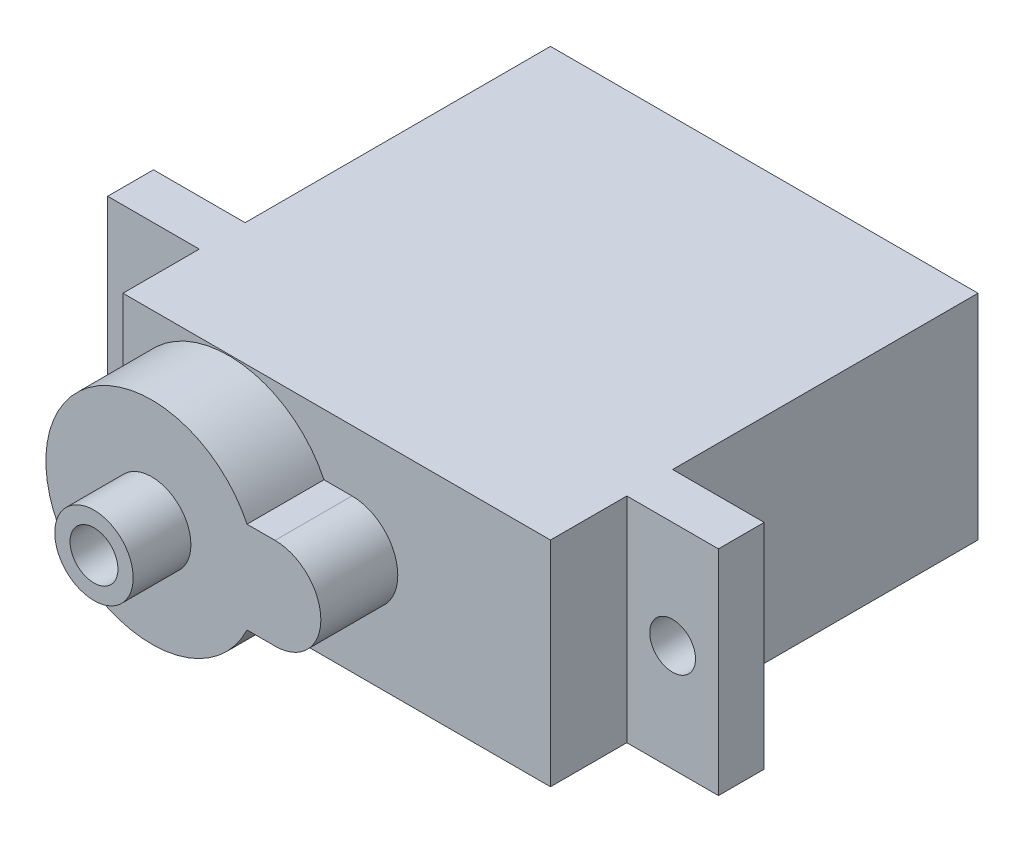
ISO-10303-21;
HEADER;
FILE_DESCRIPTION(('STEP AP214'),'2;1');
FILE_NAME('part.step','',(''),(''),'','','');
FILE_SCHEMA(('AUTOMOTIVE_DESIGN { 1 0 10303 214 1 1 1 1 }'));
ENDSEC;
DATA;
#1=APPLICATION_CONTEXT('core data for automotive mechanical design processes');
#2=APPLICATION_PROTOCOL_DEFINITION('international standard','automotive_design',2000,#1);
#3=PRODUCT_CONTEXT('',#1,'mechanical');
#4=PRODUCT('Part','Part','',(#3));
#5=PRODUCT_RELATED_PRODUCT_CATEGORY('part','',(#4));
#6=PRODUCT_DEFINITION_FORMATION('','',#4);
#7=PRODUCT_DEFINITION_CONTEXT('part definition',#1,'design');
#8=PRODUCT_DEFINITION('design','',#6,#7);
#9=PRODUCT_DEFINITION_SHAPE('','',#8);
#10=(LENGTH_UNIT() NAMED_UNIT(*) SI_UNIT(.MILLI.,.METRE.));
#11=(NAMED_UNIT(*) PLANE_ANGLE_UNIT() SI_UNIT($,.RADIAN.));
#12=(NAMED_UNIT(*) SI_UNIT($,.STERADIAN.) SOLID_ANGLE_UNIT());
#13=UNCERTAINTY_MEASURE_WITH_UNIT(LENGTH_MEASURE(1.E-05),#10,'distance_accuracy_value','');
#14=(GEOMETRIC_REPRESENTATION_CONTEXT(3) GLOBAL_UNCERTAINTY_ASSIGNED_CONTEXT((#13)) GLOBAL_UNIT_ASSIGNED_CONTEXT((#10,
#11,#12)) REPRESENTATION_CONTEXT('',''));
#15=CARTESIAN_POINT('',(0.,0.,0.));
#16=DIRECTION('',(0.,0.,1.));
#17=DIRECTION('',(1.,0.,0.));
#18=AXIS2_PLACEMENT_3D('',#15,#16,#17);
#19=CARTESIAN_POINT('',(0.,0.,26.225));
#20=DIRECTION('',(0.,0.,1.));
#21=DIRECTION('',(1.,0.,0.));
#22=AXIS2_PLACEMENT_3D('',#19,#20,#21);
#23=PLANE('',#22);
#24=DIRECTION('',(-1.,0.,0.));
#25=VECTOR('',#24,1.);
#26=CARTESIAN_POINT('',(0.,-2.38125656149906,26.225));
#27=LINE('',#26,#25);
#28=CARTESIAN_POINT('',(1.01053601839695,-2.38125656149906,26.225));
#29=VERTEX_POINT('',#28);
#30=CARTESIAN_POINT('',(-0.44419736512808,-2.38125656149906,26.225));
#31=VERTEX_POINT('',#30);
#32=EDGE_CURVE('E247',#29,#31,#27,.T.);
#33=ORIENTED_EDGE('',*,*,#32,.F.);
#34=CARTESIAN_POINT('',(1.01053601839692,3.67197356602013E-05,26.225));
#35=DIRECTION('',(0.,0.,1.));
#36=DIRECTION('',(1.,0.,0.));
#37=AXIS2_PLACEMENT_3D('',#34,#35,#36);
#38=CIRCLE('',#37,2.38129328074953);
#39=CARTESIAN_POINT('',(1.010604,2.38133,26.225));
#40=VERTEX_POINT('',#39);
#41=EDGE_CURVE('E250',#29,#40,#38,.T.);
#42=ORIENTED_EDGE('',*,*,#41,.T.);
#43=DIRECTION('',(-1.,0.,0.));
#44=VECTOR('',#43,1.);
#45=CARTESIAN_POINT('',(0.,2.38133,26.225));
#46=LINE('',#45,#44);
#47=CARTESIAN_POINT('',(-0.444232638800502,2.38133,26.225));
#48=VERTEX_POINT('',#47);
#49=EDGE_CURVE('E253',#40,#48,#46,.T.);
#50=ORIENTED_EDGE('',*,*,#49,.T.);
#51=CARTESIAN_POINT('',(-5.40198086063468,0.,26.225));
#52=DIRECTION('',(0.,0.,1.));
#53=DIRECTION('',(1.,0.,0.));
#54=AXIS2_PLACEMENT_3D('',#51,#52,#53);
#55=CIRCLE('',#54,5.5);
#56=CARTESIAN_POINT('',(-10.89565,0.263816957728569,26.225));
#57=VERTEX_POINT('',#56);
#58=EDGE_CURVE('E255',#48,#57,#55,.T.);
#59=ORIENTED_EDGE('',*,*,#58,.T.);
#60=DIRECTION('',(0.,-1.,0.));
#61=VECTOR('',#60,1.);
#62=CARTESIAN_POINT('',(-10.89565,0.,26.225));
#63=LINE('',#62,#61);
#64=CARTESIAN_POINT('',(-10.89565,-0.263816957728569,26.225));
#65=VERTEX_POINT('',#64);
#66=EDGE_CURVE('E257',#57,#65,#63,.T.);
#67=ORIENTED_EDGE('',*,*,#66,.T.);
#68=EDGE_CURVE('E258',#65,#31,#55,.T.);
#69=ORIENTED_EDGE('',*,*,#68,.T.);
#70=EDGE_LOOP('',(#33,#42,#50,#59,#67,#69));
#71=FACE_BOUND('',#70,.T.);
#72=CARTESIAN_POINT('',(-5.40198086063468,0.,26.225));
#73=DIRECTION('',(0.,0.,1.));
#74=DIRECTION('',(1.,0.,0.));
#75=AXIS2_PLACEMENT_3D('',#72,#73,#74);
#76=CIRCLE('',#75,2.0388374802303);
#77=CARTESIAN_POINT('',(-3.36314338040439,0.,26.225));
#78=VERTEX_POINT('',#77);
#79=EDGE_CURVE('E241',#78,#78,#76,.T.);
#80=ORIENTED_EDGE('',*,*,#79,.F.);
#81=EDGE_LOOP('',(#80));
#82=FACE_BOUND('',#81,.T.);
#83=ADVANCED_FACE('F39',(#71,#82),#23,.T.);
#84=CARTESIAN_POINT('',(11.32935,5.555,22.225));
#85=DIRECTION('',(0.,0.,-1.));
#86=DIRECTION('',(-1.,0.,0.));
#87=AXIS2_PLACEMENT_3D('',#84,#85,#86);
#88=PLANE('',#87);
#89=CARTESIAN_POINT('',(-5.40198086063468,0.,22.225));
#90=DIRECTION('',(0.,0.,1.));
#91=DIRECTION('',(1.,0.,0.));
#92=AXIS2_PLACEMENT_3D('',#89,#90,#91);
#93=CIRCLE('',#92,5.5);
#94=CARTESIAN_POINT('',(-10.89565,-0.263816957728569,22.225));
#95=VERTEX_POINT('',#94);
#96=CARTESIAN_POINT('',(-0.44419736512808,-2.38125656149906,22.225));
#97=VERTEX_POINT('',#96);
#98=EDGE_CURVE('E251',#95,#97,#93,.T.);
#99=ORIENTED_EDGE('',*,*,#98,.F.);
#100=DIRECTION('',(0.,-1.,0.));
#101=VECTOR('',#100,1.);
#102=CARTESIAN_POINT('',(-10.89565,5.555,22.225));
#103=LINE('',#102,#101);
#104=CARTESIAN_POINT('',(-10.89565,-5.555,22.225));
#105=VERTEX_POINT('',#104);
#106=EDGE_CURVE('E280',#95,#105,#103,.T.);
#107=ORIENTED_EDGE('',*,*,#106,.T.);
#108=DIRECTION('',(1.,0.,0.));
#109=VECTOR('',#108,1.);
#110=CARTESIAN_POINT('',(11.32935,-5.555,22.225));
#111=LINE('',#110,#109);
#112=CARTESIAN_POINT('',(11.32935,-5.555,22.225));
#113=VERTEX_POINT('',#112);
#114=EDGE_CURVE('E372',#105,#113,#111,.T.);
#115=ORIENTED_EDGE('',*,*,#114,.T.);
#116=DIRECTION('',(0.,-1.,0.));
#117=VECTOR('',#116,1.);
#118=CARTESIAN_POINT('',(11.32935,5.555,22.225));
#119=LINE('',#118,#117);
#120=CARTESIAN_POINT('',(11.32935,5.555,22.225));
#121=VERTEX_POINT('',#120);
#122=EDGE_CURVE('E330',#121,#113,#119,.T.);
#123=ORIENTED_EDGE('',*,*,#122,.F.);
#124=DIRECTION('',(1.,0.,0.));
#125=VECTOR('',#124,1.);
#126=CARTESIAN_POINT('',(11.32935,5.555,22.225));
#127=LINE('',#126,#125);
#128=CARTESIAN_POINT('',(-10.89565,5.555,22.225));
#129=VERTEX_POINT('',#128);
#130=EDGE_CURVE('E430',#129,#121,#127,.T.);
#131=ORIENTED_EDGE('',*,*,#130,.F.);
#132=CARTESIAN_POINT('',(-10.89565,0.263816957728569,22.225));
#133=VERTEX_POINT('',#132);
#134=EDGE_CURVE('E329',#129,#133,#103,.T.);
#135=ORIENTED_EDGE('',*,*,#134,.T.);
#136=CARTESIAN_POINT('',(-0.444232638800502,2.38133,22.225));
#137=VERTEX_POINT('',#136);
#138=EDGE_CURVE('E267',#137,#133,#93,.T.);
#139=ORIENTED_EDGE('',*,*,#138,.F.);
#140=DIRECTION('',(-1.,0.,0.));
#141=VECTOR('',#140,1.);
#142=CARTESIAN_POINT('',(0.,2.38133,22.225));
#143=LINE('',#142,#141);
#144=CARTESIAN_POINT('',(1.010604,2.38133,22.225));
#145=VERTEX_POINT('',#144);
#146=EDGE_CURVE('E264',#145,#137,#143,.T.);
#147=ORIENTED_EDGE('',*,*,#146,.F.);
#148=CARTESIAN_POINT('',(1.01053601839692,3.67197356602013E-05,22.225));
#149=DIRECTION('',(0.,0.,1.));
#150=DIRECTION('',(1.,0.,0.));
#151=AXIS2_PLACEMENT_3D('',#148,#149,#150);
#152=CIRCLE('',#151,2.38129328074953);
#153=CARTESIAN_POINT('',(1.01053601839695,-2.38125656149906,22.225));
#154=VERTEX_POINT('',#153);
#155=EDGE_CURVE('E261',#154,#145,#152,.T.);
#156=ORIENTED_EDGE('',*,*,#155,.F.);
#157=DIRECTION('',(-1.,0.,0.));
#158=VECTOR('',#157,1.);
#159=CARTESIAN_POINT('',(0.,-2.38125656149906,22.225));
#160=LINE('',#159,#158);
#161=EDGE_CURVE('E63',#154,#97,#160,.T.);
#162=ORIENTED_EDGE('',*,*,#161,.T.);
#163=EDGE_LOOP('',(#99,#107,#115,#123,#131,#135,#139,#147,#156,#162));
#164=FACE_BOUND('',#163,.T.);
#165=ADVANCED_FACE('F474',(#164),#88,.F.);
#166=CARTESIAN_POINT('',(11.32935,5.555,0.));
#167=DIRECTION('',(-1.,0.,0.));
#168=DIRECTION('',(0.,0.,1.));
#169=AXIS2_PLACEMENT_3D('',#166,#167,#168);
#170=PLANE('',#169);
#171=DIRECTION('',(0.,0.,-1.));
#172=VECTOR('',#171,1.);
#173=CARTESIAN_POINT('',(11.32935,-5.555,0.));
#174=LINE('',#173,#172);
#175=CARTESIAN_POINT('',(11.32935,-5.555,15.875));
#176=VERTEX_POINT('',#175);
#177=CARTESIAN_POINT('',(11.32935,-5.555,0.));
#178=VERTEX_POINT('',#177);
#179=EDGE_CURVE('E304',#176,#178,#174,.T.);
#180=ORIENTED_EDGE('',*,*,#179,.T.);
#181=DIRECTION('',(0.,-1.,0.));
#182=VECTOR('',#181,1.);
#183=CARTESIAN_POINT('',(11.32935,5.555,0.));
#184=LINE('',#183,#182);
#185=CARTESIAN_POINT('',(11.32935,5.555,0.));
#186=VERTEX_POINT('',#185);
#187=EDGE_CURVE('E48',#186,#178,#184,.T.);
#188=ORIENTED_EDGE('',*,*,#187,.F.);
#189=DIRECTION('',(0.,0.,-1.));
#190=VECTOR('',#189,1.);
#191=CARTESIAN_POINT('',(11.32935,5.555,0.));
#192=LINE('',#191,#190);
#193=CARTESIAN_POINT('',(11.32935,5.555,15.875));
#194=VERTEX_POINT('',#193);
#195=EDGE_CURVE('E387',#194,#186,#192,.T.);
#196=ORIENTED_EDGE('',*,*,#195,.F.);
#197=DIRECTION('',(0.,-1.,0.));
#198=VECTOR('',#197,1.);
#199=CARTESIAN_POINT('',(11.32935,5.555,15.875));
#200=LINE('',#199,#198);
#201=EDGE_CURVE('E388',#194,#176,#200,.T.);
#202=ORIENTED_EDGE('',*,*,#201,.T.);
#203=EDGE_LOOP('',(#180,#188,#196,#202));
#204=FACE_BOUND('',#203,.T.);
#205=ADVANCED_FACE('F41',(#204),#170,.F.);
#206=CARTESIAN_POINT('',(-10.89565,5.555,0.));
#207=DIRECTION('',(0.,0.,1.));
#208=DIRECTION('',(1.,0.,0.));
#209=AXIS2_PLACEMENT_3D('',#206,#207,#208);
#210=PLANE('',#209);
#211=DIRECTION('',(-1.,0.,0.));
#212=VECTOR('',#211,1.);
#213=CARTESIAN_POINT('',(-10.89565,-5.555,0.));
#214=LINE('',#213,#212);
#215=CARTESIAN_POINT('',(-10.89565,-5.555,0.));
#216=VERTEX_POINT('',#215);
#217=EDGE_CURVE('E439',#178,#216,#214,.T.);
#218=ORIENTED_EDGE('',*,*,#217,.T.);
#219=DIRECTION('',(0.,-1.,0.));
#220=VECTOR('',#219,1.);
#221=CARTESIAN_POINT('',(-10.89565,5.555,0.));
#222=LINE('',#221,#220);
#223=CARTESIAN_POINT('',(-10.89565,5.555,0.));
#224=VERTEX_POINT('',#223);
#225=EDGE_CURVE('E350',#224,#216,#222,.T.);
#226=ORIENTED_EDGE('',*,*,#225,.F.);
#227=DIRECTION('',(-1.,0.,0.));
#228=VECTOR('',#227,1.);
#229=CARTESIAN_POINT('',(-10.89565,5.555,0.));
#230=LINE('',#229,#228);
#231=EDGE_CURVE('E416',#186,#224,#230,.T.);
#232=ORIENTED_EDGE('',*,*,#231,.F.);
#233=ORIENTED_EDGE('',*,*,#187,.T.);
#234=EDGE_LOOP('',(#218,#226,#232,#233));
#235=FACE_BOUND('',#234,.T.);
#236=ADVANCED_FACE('F459',(#235),#210,.F.);
#237=CARTESIAN_POINT('',(-10.89565,5.555,15.875));
#238=DIRECTION('',(1.,0.,0.));
#239=DIRECTION('',(0.,0.,-1.));
#240=AXIS2_PLACEMENT_3D('',#237,#238,#239);
#241=PLANE('',#240);
#242=DIRECTION('',(0.,0.,-1.));
#243=VECTOR('',#242,1.);
#244=CARTESIAN_POINT('',(-10.89565,-2.,4.));
#245=LINE('',#244,#243);
#246=CARTESIAN_POINT('',(-10.89565,-2.,4.));
#247=VERTEX_POINT('',#246);
#248=CARTESIAN_POINT('',(-10.89565,-2.,3.));
#249=VERTEX_POINT('',#248);
#250=EDGE_CURVE('E214',#247,#249,#245,.T.);
#251=ORIENTED_EDGE('',*,*,#250,.T.);
#252=DIRECTION('',(0.,1.,0.));
#253=VECTOR('',#252,1.);
#254=CARTESIAN_POINT('',(-10.89565,-2.,3.));
#255=LINE('',#254,#253);
#256=CARTESIAN_POINT('',(-10.89565,2.,3.));
#257=VERTEX_POINT('',#256);
#258=EDGE_CURVE('E221',#249,#257,#255,.T.);
#259=ORIENTED_EDGE('',*,*,#258,.T.);
#260=DIRECTION('',(0.,0.,1.));
#261=VECTOR('',#260,1.);
#262=CARTESIAN_POINT('',(-10.89565,2.,4.));
#263=LINE('',#262,#261);
#264=CARTESIAN_POINT('',(-10.89565,2.,4.));
#265=VERTEX_POINT('',#264);
#266=EDGE_CURVE('E194',#257,#265,#263,.T.);
#267=ORIENTED_EDGE('',*,*,#266,.T.);
#268=DIRECTION('',(0.,-1.,0.));
#269=VECTOR('',#268,1.);
#270=CARTESIAN_POINT('',(-10.89565,-2.,4.));
#271=LINE('',#270,#269);
#272=EDGE_CURVE('E55',#265,#247,#271,.T.);
#273=ORIENTED_EDGE('',*,*,#272,.T.);
#274=EDGE_LOOP('',(#251,#259,#267,#273));
#275=FACE_BOUND('',#274,.T.);
#276=DIRECTION('',(0.,0.,1.));
#277=VECTOR('',#276,1.);
#278=CARTESIAN_POINT('',(-10.89565,-5.555,15.875));
#279=LINE('',#278,#277);
#280=CARTESIAN_POINT('',(-10.89565,-5.555,15.875));
#281=VERTEX_POINT('',#280);
#282=EDGE_CURVE('E441',#216,#281,#279,.T.);
#283=ORIENTED_EDGE('',*,*,#282,.T.);
#284=DIRECTION('',(0.,-1.,0.));
#285=VECTOR('',#284,1.);
#286=CARTESIAN_POINT('',(-10.89565,5.555,15.875));
#287=LINE('',#286,#285);
#288=CARTESIAN_POINT('',(-10.89565,5.555,15.875));
#289=VERTEX_POINT('',#288);
#290=EDGE_CURVE('E353',#289,#281,#287,.T.);
#291=ORIENTED_EDGE('',*,*,#290,.F.);
#292=DIRECTION('',(0.,0.,1.));
#293=VECTOR('',#292,1.);
#294=CARTESIAN_POINT('',(-10.89565,5.555,15.875));
#295=LINE('',#294,#293);
#296=EDGE_CURVE('E418',#224,#289,#295,.T.);
#297=ORIENTED_EDGE('',*,*,#296,.F.);
#298=ORIENTED_EDGE('',*,*,#225,.T.);
#299=EDGE_LOOP('',(#283,#291,#297,#298));
#300=FACE_BOUND('',#299,.T.);
#301=ADVANCED_FACE('F456',(#275,#300),#241,.F.);
#302=CARTESIAN_POINT('',(-15.65815,5.555,15.875));
#303=DIRECTION('',(0.,0.,1.));
#304=DIRECTION('',(1.,0.,0.));
#305=AXIS2_PLACEMENT_3D('',#302,#303,#304);
#306=PLANE('',#305);
#307=CARTESIAN_POINT('',(-13.2769375519628,5.85583144663195E-05,15.875));
#308=DIRECTION('',(0.,0.,1.));
#309=DIRECTION('',(1.,0.,0.));
#310=AXIS2_PLACEMENT_3D('',#307,#308,#309);
#311=CIRCLE('',#310,1.19060291253007);
#312=CARTESIAN_POINT('',(-12.0863346394327,5.85583144663195E-05,15.875));
#313=VERTEX_POINT('',#312);
#314=EDGE_CURVE('E235',#313,#313,#311,.T.);
#315=ORIENTED_EDGE('',*,*,#314,.T.);
#316=EDGE_LOOP('',(#315));
#317=FACE_BOUND('',#316,.T.);
#318=DIRECTION('',(-1.,0.,0.));
#319=VECTOR('',#318,1.);
#320=CARTESIAN_POINT('',(-15.65815,-5.555,15.875));
#321=LINE('',#320,#319);
#322=CARTESIAN_POINT('',(-15.65815,-5.555,15.875));
#323=VERTEX_POINT('',#322);
#324=EDGE_CURVE('E443',#281,#323,#321,.T.);
#325=ORIENTED_EDGE('',*,*,#324,.T.);
#326=DIRECTION('',(0.,-1.,0.));
#327=VECTOR('',#326,1.);
#328=CARTESIAN_POINT('',(-15.65815,5.555,15.875));
#329=LINE('',#328,#327);
#330=CARTESIAN_POINT('',(-15.65815,5.555,15.875));
#331=VERTEX_POINT('',#330);
#332=EDGE_CURVE('E356',#331,#323,#329,.T.);
#333=ORIENTED_EDGE('',*,*,#332,.F.);
#334=DIRECTION('',(-1.,0.,0.));
#335=VECTOR('',#334,1.);
#336=CARTESIAN_POINT('',(-15.65815,5.555,15.875));
#337=LINE('',#336,#335);
#338=EDGE_CURVE('E423',#289,#331,#337,.T.);
#339=ORIENTED_EDGE('',*,*,#338,.F.);
#340=ORIENTED_EDGE('',*,*,#290,.T.);
#341=EDGE_LOOP('',(#325,#333,#339,#340));
#342=FACE_BOUND('',#341,.T.);
#343=ADVANCED_FACE('F451',(#317,#342),#306,.F.);
#344=CARTESIAN_POINT('',(-15.65815,5.555,18.25625));
#345=DIRECTION('',(1.,0.,0.));
#346=DIRECTION('',(0.,0.,-1.));
#347=AXIS2_PLACEMENT_3D('',#344,#345,#346);
#348=PLANE('',#347);
#349=DIRECTION('',(0.,0.,1.));
#350=VECTOR('',#349,1.);
#351=CARTESIAN_POINT('',(-15.65815,-5.555,18.25625));
#352=LINE('',#351,#350);
#353=CARTESIAN_POINT('',(-15.65815,-5.555,18.25625));
#354=VERTEX_POINT('',#353);
#355=EDGE_CURVE('E376',#323,#354,#352,.T.);
#356=ORIENTED_EDGE('',*,*,#355,.T.);
#357=DIRECTION('',(0.,-1.,0.));
#358=VECTOR('',#357,1.);
#359=CARTESIAN_POINT('',(-15.65815,5.555,18.25625));
#360=LINE('',#359,#358);
#361=CARTESIAN_POINT('',(-15.65815,5.555,18.25625));
#362=VERTEX_POINT('',#361);
#363=EDGE_CURVE('E358',#362,#354,#360,.T.);
#364=ORIENTED_EDGE('',*,*,#363,.F.);
#365=DIRECTION('',(0.,0.,1.));
#366=VECTOR('',#365,1.);
#367=CARTESIAN_POINT('',(-15.65815,5.555,18.25625));
#368=LINE('',#367,#366);
#369=EDGE_CURVE('E425',#331,#362,#368,.T.);
#370=ORIENTED_EDGE('',*,*,#369,.F.);
#371=ORIENTED_EDGE('',*,*,#332,.T.);
#372=EDGE_LOOP('',(#356,#364,#370,#371));
#373=FACE_BOUND('',#372,.T.);
#374=ADVANCED_FACE('F445',(#373),#348,.F.);
#375=CARTESIAN_POINT('',(-10.89565,5.555,18.25625));
#376=DIRECTION('',(0.,0.,-1.));
#377=DIRECTION('',(-1.,0.,0.));
#378=AXIS2_PLACEMENT_3D('',#375,#376,#377);
#379=PLANE('',#378);
#380=CARTESIAN_POINT('',(-13.2769375519628,5.85583144663195E-05,18.25625));
#381=DIRECTION('',(0.,0.,1.));
#382=DIRECTION('',(1.,0.,0.));
#383=AXIS2_PLACEMENT_3D('',#380,#381,#382);
#384=CIRCLE('',#383,1.19060291253007);
#385=CARTESIAN_POINT('',(-12.0863346394327,5.85583144663195E-05,18.25625));
#386=VERTEX_POINT('',#385);
#387=EDGE_CURVE('E232',#386,#386,#384,.T.);
#388=ORIENTED_EDGE('',*,*,#387,.F.);
#389=EDGE_LOOP('',(#388));
#390=FACE_BOUND('',#389,.T.);
#391=DIRECTION('',(1.,0.,0.));
#392=VECTOR('',#391,1.);
#393=CARTESIAN_POINT('',(-10.89565,-5.555,18.25625));
#394=LINE('',#393,#392);
#395=CARTESIAN_POINT('',(-10.89565,-5.555,18.25625));
#396=VERTEX_POINT('',#395);
#397=EDGE_CURVE('E371',#354,#396,#394,.T.);
#398=ORIENTED_EDGE('',*,*,#397,.T.);
#399=DIRECTION('',(0.,-1.,0.));
#400=VECTOR('',#399,1.);
#401=CARTESIAN_POINT('',(-10.89565,5.555,18.25625));
#402=LINE('',#401,#400);
#403=CARTESIAN_POINT('',(-10.89565,5.555,18.25625));
#404=VERTEX_POINT('',#403);
#405=EDGE_CURVE('E331',#404,#396,#402,.T.);
#406=ORIENTED_EDGE('',*,*,#405,.F.);
#407=DIRECTION('',(1.,0.,0.));
#408=VECTOR('',#407,1.);
#409=CARTESIAN_POINT('',(-10.89565,5.555,18.25625));
#410=LINE('',#409,#408);
#411=EDGE_CURVE('E427',#362,#404,#410,.T.);
#412=ORIENTED_EDGE('',*,*,#411,.F.);
#413=ORIENTED_EDGE('',*,*,#363,.T.);
#414=EDGE_LOOP('',(#398,#406,#412,#413));
#415=FACE_BOUND('',#414,.T.);
#416=ADVANCED_FACE('F461',(#390,#415),#379,.F.);
#417=CARTESIAN_POINT('',(-10.89565,5.555,22.225));
#418=DIRECTION('',(1.,0.,0.));
#419=DIRECTION('',(0.,0.,-1.));
#420=AXIS2_PLACEMENT_3D('',#417,#418,#419);
#421=PLANE('',#420);
#422=DIRECTION('',(0.,0.,1.));
#423=VECTOR('',#422,1.);
#424=CARTESIAN_POINT('',(-10.89565,-5.555,22.225));
#425=LINE('',#424,#423);
#426=EDGE_CURVE('E327',#396,#105,#425,.T.);
#427=ORIENTED_EDGE('',*,*,#426,.T.);
#428=ORIENTED_EDGE('',*,*,#106,.F.);
#429=DIRECTION('',(0.,0.,-1.));
#430=VECTOR('',#429,1.);
#431=CARTESIAN_POINT('',(-10.89565,-0.263816957728569,26.225));
#432=LINE('',#431,#430);
#433=EDGE_CURVE('E283',#65,#95,#432,.T.);
#434=ORIENTED_EDGE('',*,*,#433,.F.);
#435=ORIENTED_EDGE('',*,*,#66,.F.);
#436=DIRECTION('',(0.,0.,-1.));
#437=VECTOR('',#436,1.);
#438=CARTESIAN_POINT('',(-10.89565,0.263816957728569,26.225));
#439=LINE('',#438,#437);
#440=EDGE_CURVE('E285',#57,#133,#439,.T.);
#441=ORIENTED_EDGE('',*,*,#440,.T.);
#442=ORIENTED_EDGE('',*,*,#134,.F.);
#443=DIRECTION('',(0.,0.,1.));
#444=VECTOR('',#443,1.);
#445=CARTESIAN_POINT('',(-10.89565,5.555,22.225));
#446=LINE('',#445,#444);
#447=EDGE_CURVE('E366',#404,#129,#446,.T.);
#448=ORIENTED_EDGE('',*,*,#447,.F.);
#449=ORIENTED_EDGE('',*,*,#405,.T.);
#450=EDGE_LOOP('',(#427,#428,#434,#435,#441,#442,#448,#449));
#451=FACE_BOUND('',#450,.T.);
#452=ADVANCED_FACE('F323',(#451),#421,.F.);
#453=CARTESIAN_POINT('',(11.32935,5.555,18.25625));
#454=DIRECTION('',(-1.,0.,0.));
#455=DIRECTION('',(0.,0.,1.));
#456=AXIS2_PLACEMENT_3D('',#453,#454,#455);
#457=PLANE('',#456);
#458=DIRECTION('',(0.,0.,-1.));
#459=VECTOR('',#458,1.);
#460=CARTESIAN_POINT('',(11.32935,-5.555,18.25625));
#461=LINE('',#460,#459);
#462=CARTESIAN_POINT('',(11.32935,-5.555,18.25625));
#463=VERTEX_POINT('',#462);
#464=EDGE_CURVE('E374',#113,#463,#461,.T.);
#465=ORIENTED_EDGE('',*,*,#464,.T.);
#466=DIRECTION('',(0.,-1.,0.));
#467=VECTOR('',#466,1.);
#468=CARTESIAN_POINT('',(11.32935,5.555,18.25625));
#469=LINE('',#468,#467);
#470=CARTESIAN_POINT('',(11.32935,5.555,18.25625));
#471=VERTEX_POINT('',#470);
#472=EDGE_CURVE('E333',#471,#463,#469,.T.);
#473=ORIENTED_EDGE('',*,*,#472,.F.);
#474=DIRECTION('',(0.,0.,-1.));
#475=VECTOR('',#474,1.);
#476=CARTESIAN_POINT('',(11.32935,5.555,18.25625));
#477=LINE('',#476,#475);
#478=EDGE_CURVE('E432',#121,#471,#477,.T.);
#479=ORIENTED_EDGE('',*,*,#478,.F.);
#480=ORIENTED_EDGE('',*,*,#122,.T.);
#481=EDGE_LOOP('',(#465,#473,#479,#480));
#482=FACE_BOUND('',#481,.T.);
#483=ADVANCED_FACE('F469',(#482),#457,.F.);
#484=CARTESIAN_POINT('',(16.09185,5.555,18.25625));
#485=DIRECTION('',(0.,0.,-1.));
#486=DIRECTION('',(-1.,0.,0.));
#487=AXIS2_PLACEMENT_3D('',#484,#485,#486);
#488=PLANE('',#487);
#489=CARTESIAN_POINT('',(13.7105365803843,6.14151503597256E-05,18.25625));
#490=DIRECTION('',(0.,0.,1.));
#491=DIRECTION('',(1.,0.,0.));
#492=AXIS2_PLACEMENT_3D('',#489,#490,#491);
#493=CIRCLE('',#492,1.1906024302544);
#494=CARTESIAN_POINT('',(14.9011390106387,6.14151503597256E-05,18.25625));
#495=VERTEX_POINT('',#494);
#496=EDGE_CURVE('E226',#495,#495,#493,.T.);
#497=ORIENTED_EDGE('',*,*,#496,.F.);
#498=EDGE_LOOP('',(#497));
#499=FACE_BOUND('',#498,.T.);
#500=DIRECTION('',(1.,0.,0.));
#501=VECTOR('',#500,1.);
#502=CARTESIAN_POINT('',(16.09185,-5.555,18.25625));
#503=LINE('',#502,#501);
#504=CARTESIAN_POINT('',(16.09185,-5.555,18.25625));
#505=VERTEX_POINT('',#504);
#506=EDGE_CURVE('E381',#463,#505,#503,.T.);
#507=ORIENTED_EDGE('',*,*,#506,.T.);
#508=DIRECTION('',(0.,-1.,0.));
#509=VECTOR('',#508,1.);
#510=CARTESIAN_POINT('',(16.09185,5.555,18.25625));
#511=LINE('',#510,#509);
#512=CARTESIAN_POINT('',(16.09185,5.555,18.25625));
#513=VERTEX_POINT('',#512);
#514=EDGE_CURVE('E340',#513,#505,#511,.T.);
#515=ORIENTED_EDGE('',*,*,#514,.F.);
#516=DIRECTION('',(1.,0.,0.));
#517=VECTOR('',#516,1.);
#518=CARTESIAN_POINT('',(16.09185,5.555,18.25625));
#519=LINE('',#518,#517);
#520=EDGE_CURVE('E434',#471,#513,#519,.T.);
#521=ORIENTED_EDGE('',*,*,#520,.F.);
#522=ORIENTED_EDGE('',*,*,#472,.T.);
#523=EDGE_LOOP('',(#507,#515,#521,#522));
#524=FACE_BOUND('',#523,.T.);
#525=ADVANCED_FACE('F535',(#499,#524),#488,.F.);
#526=CARTESIAN_POINT('',(16.09185,5.555,15.875));
#527=DIRECTION('',(-1.,0.,0.));
#528=DIRECTION('',(0.,0.,1.));
#529=AXIS2_PLACEMENT_3D('',#526,#527,#528);
#530=PLANE('',#529);
#531=DIRECTION('',(0.,0.,-1.));
#532=VECTOR('',#531,1.);
#533=CARTESIAN_POINT('',(16.09185,-5.555,15.875));
#534=LINE('',#533,#532);
#535=CARTESIAN_POINT('',(16.09185,-5.555,15.875));
#536=VERTEX_POINT('',#535);
#537=EDGE_CURVE('E383',#505,#536,#534,.T.);
#538=ORIENTED_EDGE('',*,*,#537,.T.);
#539=DIRECTION('',(0.,-1.,0.));
#540=VECTOR('',#539,1.);
#541=CARTESIAN_POINT('',(16.09185,5.555,15.875));
#542=LINE('',#541,#540);
#543=CARTESIAN_POINT('',(16.09185,5.555,15.875));
#544=VERTEX_POINT('',#543);
#545=EDGE_CURVE('E391',#544,#536,#542,.T.);
#546=ORIENTED_EDGE('',*,*,#545,.F.);
#547=DIRECTION('',(0.,0.,-1.));
#548=VECTOR('',#547,1.);
#549=CARTESIAN_POINT('',(16.09185,5.555,15.875));
#550=LINE('',#549,#548);
#551=EDGE_CURVE('E401',#513,#544,#550,.T.);
#552=ORIENTED_EDGE('',*,*,#551,.F.);
#553=ORIENTED_EDGE('',*,*,#514,.T.);
#554=EDGE_LOOP('',(#538,#546,#552,#553));
#555=FACE_BOUND('',#554,.T.);
#556=ADVANCED_FACE('F399',(#555),#530,.F.);
#557=CARTESIAN_POINT('',(11.32935,5.555,15.875));
#558=DIRECTION('',(0.,0.,1.));
#559=DIRECTION('',(1.,0.,0.));
#560=AXIS2_PLACEMENT_3D('',#557,#558,#559);
#561=PLANE('',#560);
#562=CARTESIAN_POINT('',(13.7105365803843,6.14151503597256E-05,15.875));
#563=DIRECTION('',(0.,0.,1.));
#564=DIRECTION('',(1.,0.,0.));
#565=AXIS2_PLACEMENT_3D('',#562,#563,#564);
#566=CIRCLE('',#565,1.1906024302544);
#567=CARTESIAN_POINT('',(14.9011390106387,6.14151503597256E-05,15.875));
#568=VERTEX_POINT('',#567);
#569=EDGE_CURVE('E43',#568,#568,#566,.T.);
#570=ORIENTED_EDGE('',*,*,#569,.T.);
#571=EDGE_LOOP('',(#570));
#572=FACE_BOUND('',#571,.T.);
#573=DIRECTION('',(-1.,0.,0.));
#574=VECTOR('',#573,1.);
#575=CARTESIAN_POINT('',(11.32935,-5.555,15.875));
#576=LINE('',#575,#574);
#577=EDGE_CURVE('E385',#536,#176,#576,.T.);
#578=ORIENTED_EDGE('',*,*,#577,.T.);
#579=ORIENTED_EDGE('',*,*,#201,.F.);
#580=DIRECTION('',(-1.,0.,0.));
#581=VECTOR('',#580,1.);
#582=CARTESIAN_POINT('',(11.32935,5.555,15.875));
#583=LINE('',#582,#581);
#584=EDGE_CURVE('E392',#544,#194,#583,.T.);
#585=ORIENTED_EDGE('',*,*,#584,.F.);
#586=ORIENTED_EDGE('',*,*,#545,.T.);
#587=EDGE_LOOP('',(#578,#579,#585,#586));
#588=FACE_BOUND('',#587,.T.);
#589=ADVANCED_FACE('F409',(#572,#588),#561,.F.);
#590=CARTESIAN_POINT('',(0.,5.555,0.));
#591=DIRECTION('',(0.,1.,0.));
#592=DIRECTION('',(0.,0.,1.));
#593=AXIS2_PLACEMENT_3D('',#590,#591,#592);
#594=PLANE('',#593);
#595=ORIENTED_EDGE('',*,*,#195,.T.);
#596=ORIENTED_EDGE('',*,*,#231,.T.);
#597=ORIENTED_EDGE('',*,*,#296,.T.);
#598=ORIENTED_EDGE('',*,*,#338,.T.);
#599=ORIENTED_EDGE('',*,*,#369,.T.);
#600=ORIENTED_EDGE('',*,*,#411,.T.);
#601=ORIENTED_EDGE('',*,*,#447,.T.);
#602=ORIENTED_EDGE('',*,*,#130,.T.);
#603=ORIENTED_EDGE('',*,*,#478,.T.);
#604=ORIENTED_EDGE('',*,*,#520,.T.);
#605=ORIENTED_EDGE('',*,*,#551,.T.);
#606=ORIENTED_EDGE('',*,*,#584,.T.);
#607=EDGE_LOOP('',(#595,#596,#597,#598,#599,#600,#601,#602,#603,#604,#605,#606));
#608=FACE_BOUND('',#607,.T.);
#609=ADVANCED_FACE('F460',(#608),#594,.T.);
#610=CARTESIAN_POINT('',(0.,-5.555,0.));
#611=DIRECTION('',(0.,1.,0.));
#612=DIRECTION('',(0.,0.,1.));
#613=AXIS2_PLACEMENT_3D('',#610,#611,#612);
#614=PLANE('',#613);
#615=ORIENTED_EDGE('',*,*,#179,.F.);
#616=ORIENTED_EDGE('',*,*,#577,.F.);
#617=ORIENTED_EDGE('',*,*,#537,.F.);
#618=ORIENTED_EDGE('',*,*,#506,.F.);
#619=ORIENTED_EDGE('',*,*,#464,.F.);
#620=ORIENTED_EDGE('',*,*,#114,.F.);
#621=ORIENTED_EDGE('',*,*,#426,.F.);
#622=ORIENTED_EDGE('',*,*,#397,.F.);
#623=ORIENTED_EDGE('',*,*,#355,.F.);
#624=ORIENTED_EDGE('',*,*,#324,.F.);
#625=ORIENTED_EDGE('',*,*,#282,.F.);
#626=ORIENTED_EDGE('',*,*,#217,.F.);
#627=EDGE_LOOP('',(#615,#616,#617,#618,#619,#620,#621,#622,#623,#624,#625,#626));
#628=FACE_BOUND('',#627,.T.);
#629=ADVANCED_FACE('F369',(#628),#614,.F.);
#630=CARTESIAN_POINT('',(0.,-2.38125656149906,26.225));
#631=DIRECTION('',(0.,-1.,0.));
#632=DIRECTION('',(0.,0.,-1.));
#633=AXIS2_PLACEMENT_3D('',#630,#631,#632);
#634=PLANE('',#633);
#635=ORIENTED_EDGE('',*,*,#161,.F.);
#636=DIRECTION('',(0.,0.,-1.));
#637=VECTOR('',#636,1.);
#638=CARTESIAN_POINT('',(1.01053601839695,-2.38125656149906,26.225));
#639=LINE('',#638,#637);
#640=EDGE_CURVE('E301',#29,#154,#639,.T.);
#641=ORIENTED_EDGE('',*,*,#640,.F.);
#642=ORIENTED_EDGE('',*,*,#32,.T.);
#643=DIRECTION('',(0.,0.,-1.));
#644=VECTOR('',#643,1.);
#645=CARTESIAN_POINT('',(-0.44419736512808,-2.38125656149906,26.225));
#646=LINE('',#645,#644);
#647=EDGE_CURVE('E270',#31,#97,#646,.T.);
#648=ORIENTED_EDGE('',*,*,#647,.T.);
#649=EDGE_LOOP('',(#635,#641,#642,#648));
#650=FACE_BOUND('',#649,.T.);
#651=ADVANCED_FACE('F299',(#650),#634,.T.);
#652=CARTESIAN_POINT('',(1.01053601839692,3.67197356602013E-05,26.225));
#653=DIRECTION('',(0.,0.,-1.));
#654=DIRECTION('',(-1.,0.,0.));
#655=AXIS2_PLACEMENT_3D('',#652,#653,#654);
#656=CYLINDRICAL_SURFACE('',#655,2.38129328074953);
#657=ORIENTED_EDGE('',*,*,#155,.T.);
#658=DIRECTION('',(0.,0.,-1.));
#659=VECTOR('',#658,1.);
#660=CARTESIAN_POINT('',(1.010604,2.38133,26.225));
#661=LINE('',#660,#659);
#662=EDGE_CURVE('E305',#40,#145,#661,.T.);
#663=ORIENTED_EDGE('',*,*,#662,.F.);
#664=ORIENTED_EDGE('',*,*,#41,.F.);
#665=ORIENTED_EDGE('',*,*,#640,.T.);
#666=EDGE_LOOP('',(#657,#663,#664,#665));
#667=FACE_BOUND('',#666,.T.);
#668=ADVANCED_FACE('F308',(#667),#656,.T.);
#669=CARTESIAN_POINT('',(0.,2.38133,26.225));
#670=DIRECTION('',(0.,-1.,0.));
#671=DIRECTION('',(0.,0.,-1.));
#672=AXIS2_PLACEMENT_3D('',#669,#670,#671);
#673=PLANE('',#672);
#674=ORIENTED_EDGE('',*,*,#146,.T.);
#675=DIRECTION('',(0.,0.,-1.));
#676=VECTOR('',#675,1.);
#677=CARTESIAN_POINT('',(-0.444232638800502,2.38133,26.225));
#678=LINE('',#677,#676);
#679=EDGE_CURVE('E291',#48,#137,#678,.T.);
#680=ORIENTED_EDGE('',*,*,#679,.F.);
#681=ORIENTED_EDGE('',*,*,#49,.F.);
#682=ORIENTED_EDGE('',*,*,#662,.T.);
#683=EDGE_LOOP('',(#674,#680,#681,#682));
#684=FACE_BOUND('',#683,.T.);
#685=ADVANCED_FACE('F316',(#684),#673,.F.);
#686=CARTESIAN_POINT('',(-5.40198086063468,0.,26.225));
#687=DIRECTION('',(0.,0.,-1.));
#688=DIRECTION('',(-1.,0.,0.));
#689=AXIS2_PLACEMENT_3D('',#686,#687,#688);
#690=CYLINDRICAL_SURFACE('',#689,5.5);
#691=ORIENTED_EDGE('',*,*,#138,.T.);
#692=ORIENTED_EDGE('',*,*,#440,.F.);
#693=ORIENTED_EDGE('',*,*,#58,.F.);
#694=ORIENTED_EDGE('',*,*,#679,.T.);
#695=EDGE_LOOP('',(#691,#692,#693,#694));
#696=FACE_BOUND('',#695,.T.);
#697=ADVANCED_FACE('F319',(#696),#690,.T.);
#698=ORIENTED_EDGE('',*,*,#98,.T.);
#699=ORIENTED_EDGE('',*,*,#647,.F.);
#700=ORIENTED_EDGE('',*,*,#68,.F.);
#701=ORIENTED_EDGE('',*,*,#433,.T.);
#702=EDGE_LOOP('',(#698,#699,#700,#701));
#703=FACE_BOUND('',#702,.T.);
#704=ADVANCED_FACE('F298',(#703),#690,.T.);
#705=CARTESIAN_POINT('',(-5.40198086063468,0.,29.225));
#706=DIRECTION('',(0.,0.,1.));
#707=DIRECTION('',(1.,0.,0.));
#708=AXIS2_PLACEMENT_3D('',#705,#706,#707);
#709=PLANE('',#708);
#710=CARTESIAN_POINT('',(-5.40198086063468,0.,29.225));
#711=DIRECTION('',(0.,0.,1.));
#712=DIRECTION('',(1.,0.,0.));
#713=AXIS2_PLACEMENT_3D('',#710,#711,#712);
#714=CIRCLE('',#713,2.0388374802303);
#715=CARTESIAN_POINT('',(-3.36314338040439,0.,29.225));
#716=VERTEX_POINT('',#715);
#717=EDGE_CURVE('E242',#716,#716,#714,.T.);
#718=ORIENTED_EDGE('',*,*,#717,.T.);
#719=EDGE_LOOP('',(#718));
#720=FACE_BOUND('',#719,.T.);
#721=CARTESIAN_POINT('',(-5.40198086063468,0.,29.225));
#722=DIRECTION('',(0.,0.,1.));
#723=DIRECTION('',(1.,0.,0.));
#724=AXIS2_PLACEMENT_3D('',#721,#722,#723);
#725=CIRCLE('',#724,1.24519559043406);
#726=CARTESIAN_POINT('',(-4.15678527020062,0.,29.225));
#727=VERTEX_POINT('',#726);
#728=EDGE_CURVE('E238',#727,#727,#725,.T.);
#729=ORIENTED_EDGE('',*,*,#728,.F.);
#730=EDGE_LOOP('',(#729));
#731=FACE_BOUND('',#730,.T.);
#732=ADVANCED_FACE('F502',(#720,#731),#709,.T.);
#733=CARTESIAN_POINT('',(-5.40198086063468,0.,29.225));
#734=DIRECTION('',(0.,0.,-1.));
#735=DIRECTION('',(-1.,0.,0.));
#736=AXIS2_PLACEMENT_3D('',#733,#734,#735);
#737=CYLINDRICAL_SURFACE('',#736,2.0388374802303);
#738=ORIENTED_EDGE('',*,*,#717,.F.);
#739=EDGE_LOOP('',(#738));
#740=FACE_BOUND('',#739,.T.);
#741=ORIENTED_EDGE('',*,*,#79,.T.);
#742=EDGE_LOOP('',(#741));
#743=FACE_BOUND('',#742,.T.);
#744=ADVANCED_FACE('F494',(#740,#743),#737,.T.);
#745=CARTESIAN_POINT('',(-5.40198086063468,0.,29.225));
#746=DIRECTION('',(0.,0.,-1.));
#747=DIRECTION('',(-1.,0.,0.));
#748=AXIS2_PLACEMENT_3D('',#745,#746,#747);
#749=CYLINDRICAL_SURFACE('',#748,1.24519559043406);
#750=ORIENTED_EDGE('',*,*,#728,.T.);
#751=EDGE_LOOP('',(#750));
#752=FACE_BOUND('',#751,.T.);
#753=CARTESIAN_POINT('',(-5.40198086063468,0.,26.225));
#754=DIRECTION('',(0.,0.,1.));
#755=DIRECTION('',(1.,0.,0.));
#756=AXIS2_PLACEMENT_3D('',#753,#754,#755);
#757=CIRCLE('',#756,1.24519559043406);
#758=CARTESIAN_POINT('',(-4.15678527020062,0.,26.225));
#759=VERTEX_POINT('',#758);
#760=EDGE_CURVE('E11',#759,#759,#757,.F.);
#761=ORIENTED_EDGE('',*,*,#760,.T.);
#762=EDGE_LOOP('',(#761));
#763=FACE_BOUND('',#762,.T.);
#764=ADVANCED_FACE('F485',(#752,#763),#749,.F.);
#765=ORIENTED_EDGE('',*,*,#760,.F.);
#766=EDGE_LOOP('',(#765));
#767=FACE_BOUND('',#766,.T.);
#768=ADVANCED_FACE('F476',(#767),#23,.T.);
#769=CARTESIAN_POINT('',(-13.2769375519628,5.85583144663195E-05,-4.74375));
#770=DIRECTION('',(0.,0.,1.));
#771=DIRECTION('',(1.,0.,0.));
#772=AXIS2_PLACEMENT_3D('',#769,#770,#771);
#773=CYLINDRICAL_SURFACE('',#772,1.19060291253007);
#774=ORIENTED_EDGE('',*,*,#387,.T.);
#775=EDGE_LOOP('',(#774));
#776=FACE_BOUND('',#775,.T.);
#777=ORIENTED_EDGE('',*,*,#314,.F.);
#778=EDGE_LOOP('',(#777));
#779=FACE_BOUND('',#778,.T.);
#780=ADVANCED_FACE('F484',(#776,#779),#773,.F.);
#781=CARTESIAN_POINT('',(13.7105365803843,6.14151503597256E-05,-4.74375));
#782=DIRECTION('',(0.,0.,1.));
#783=DIRECTION('',(1.,0.,0.));
#784=AXIS2_PLACEMENT_3D('',#781,#782,#783);
#785=CYLINDRICAL_SURFACE('',#784,1.1906024302544);
#786=ORIENTED_EDGE('',*,*,#496,.T.);
#787=EDGE_LOOP('',(#786));
#788=FACE_BOUND('',#787,.T.);
#789=ORIENTED_EDGE('',*,*,#569,.F.);
#790=EDGE_LOOP('',(#789));
#791=FACE_BOUND('',#790,.T.);
#792=ADVANCED_FACE('F491',(#788,#791),#785,.F.);
#793=CARTESIAN_POINT('',(-11.89565,-2.,3.));
#794=DIRECTION('',(0.,0.,-1.));
#795=DIRECTION('',(-1.,0.,0.));
#796=AXIS2_PLACEMENT_3D('',#793,#794,#795);
#797=PLANE('',#796);
#798=ORIENTED_EDGE('',*,*,#258,.F.);
#799=DIRECTION('',(1.,0.,0.));
#800=VECTOR('',#799,1.);
#801=CARTESIAN_POINT('',(-11.89565,-2.,3.));
#802=LINE('',#801,#800);
#803=CARTESIAN_POINT('',(-11.89565,-2.,3.));
#804=VERTEX_POINT('',#803);
#805=EDGE_CURVE('E213',#804,#249,#802,.T.);
#806=ORIENTED_EDGE('',*,*,#805,.F.);
#807=DIRECTION('',(0.,1.,0.));
#808=VECTOR('',#807,1.);
#809=CARTESIAN_POINT('',(-11.89565,-2.,3.));
#810=LINE('',#809,#808);
#811=CARTESIAN_POINT('',(-11.89565,2.,3.));
#812=VERTEX_POINT('',#811);
#813=EDGE_CURVE('E207',#804,#812,#810,.T.);
#814=ORIENTED_EDGE('',*,*,#813,.T.);
#815=DIRECTION('',(1.,0.,0.));
#816=VECTOR('',#815,1.);
#817=CARTESIAN_POINT('',(-11.89565,2.,3.));
#818=LINE('',#817,#816);
#819=EDGE_CURVE('E189',#812,#257,#818,.T.);
#820=ORIENTED_EDGE('',*,*,#819,.T.);
#821=EDGE_LOOP('',(#798,#806,#814,#820));
#822=FACE_BOUND('',#821,.T.);
#823=ADVANCED_FACE('F212',(#822),#797,.T.);
#824=CARTESIAN_POINT('',(-11.89565,-2.,4.));
#825=DIRECTION('',(0.,-1.,0.));
#826=DIRECTION('',(0.,0.,-1.));
#827=AXIS2_PLACEMENT_3D('',#824,#825,#826);
#828=PLANE('',#827);
#829=ORIENTED_EDGE('',*,*,#250,.F.);
#830=DIRECTION('',(1.,0.,0.));
#831=VECTOR('',#830,1.);
#832=CARTESIAN_POINT('',(-11.89565,-2.,4.));
#833=LINE('',#832,#831);
#834=CARTESIAN_POINT('',(-11.89565,-2.,4.));
#835=VERTEX_POINT('',#834);
#836=EDGE_CURVE('E227',#835,#247,#833,.T.);
#837=ORIENTED_EDGE('',*,*,#836,.F.);
#838=DIRECTION('',(0.,0.,-1.));
#839=VECTOR('',#838,1.);
#840=CARTESIAN_POINT('',(-11.89565,-2.,4.));
#841=LINE('',#840,#839);
#842=EDGE_CURVE('E200',#835,#804,#841,.T.);
#843=ORIENTED_EDGE('',*,*,#842,.T.);
#844=ORIENTED_EDGE('',*,*,#805,.T.);
#845=EDGE_LOOP('',(#829,#837,#843,#844));
#846=FACE_BOUND('',#845,.T.);
#847=ADVANCED_FACE('F684',(#846),#828,.T.);
#848=CARTESIAN_POINT('',(-11.89565,-2.,4.));
#849=DIRECTION('',(0.,0.,1.));
#850=DIRECTION('',(0.,-1.,0.));
#851=AXIS2_PLACEMENT_3D('',#848,#849,#850);
#852=PLANE('',#851);
#853=ORIENTED_EDGE('',*,*,#272,.F.);
#854=DIRECTION('',(1.,0.,0.));
#855=VECTOR('',#854,1.);
#856=CARTESIAN_POINT('',(-11.89565,2.,4.));
#857=LINE('',#856,#855);
#858=CARTESIAN_POINT('',(-11.89565,2.,4.));
#859=VERTEX_POINT('',#858);
#860=EDGE_CURVE('E199',#859,#265,#857,.T.);
#861=ORIENTED_EDGE('',*,*,#860,.F.);
#862=DIRECTION('',(0.,-1.,0.));
#863=VECTOR('',#862,1.);
#864=CARTESIAN_POINT('',(-11.89565,-2.,4.));
#865=LINE('',#864,#863);
#866=EDGE_CURVE('E210',#859,#835,#865,.T.);
#867=ORIENTED_EDGE('',*,*,#866,.T.);
#868=ORIENTED_EDGE('',*,*,#836,.T.);
#869=EDGE_LOOP('',(#853,#861,#867,#868));
#870=FACE_BOUND('',#869,.T.);
#871=ADVANCED_FACE('F693',(#870),#852,.T.);
#872=CARTESIAN_POINT('',(-11.89565,2.,4.));
#873=DIRECTION('',(0.,1.,0.));
#874=DIRECTION('',(0.,0.,1.));
#875=AXIS2_PLACEMENT_3D('',#872,#873,#874);
#876=PLANE('',#875);
#877=ORIENTED_EDGE('',*,*,#266,.F.);
#878=ORIENTED_EDGE('',*,*,#819,.F.);
#879=DIRECTION('',(0.,0.,1.));
#880=VECTOR('',#879,1.);
#881=CARTESIAN_POINT('',(-11.89565,2.,4.));
#882=LINE('',#881,#880);
#883=EDGE_CURVE('E192',#812,#859,#882,.T.);
#884=ORIENTED_EDGE('',*,*,#883,.T.);
#885=ORIENTED_EDGE('',*,*,#860,.T.);
#886=EDGE_LOOP('',(#877,#878,#884,#885));
#887=FACE_BOUND('',#886,.T.);
#888=ADVANCED_FACE('F191',(#887),#876,.T.);
#889=CARTESIAN_POINT('',(-11.89565,0.,0.));
#890=DIRECTION('',(-1.,0.,0.));
#891=DIRECTION('',(0.,0.,1.));
#892=AXIS2_PLACEMENT_3D('',#889,#890,#891);
#893=PLANE('',#892);
#894=ORIENTED_EDGE('',*,*,#813,.F.);
#895=ORIENTED_EDGE('',*,*,#842,.F.);
#896=ORIENTED_EDGE('',*,*,#866,.F.);
#897=ORIENTED_EDGE('',*,*,#883,.F.);
#898=EDGE_LOOP('',(#894,#895,#896,#897));
#899=FACE_BOUND('',#898,.T.);
#900=ADVANCED_FACE('F205',(#899),#893,.T.);
#901=CLOSED_SHELL('',(#83,#165,#205,#236,#301,#343,#374,#416,#452,#483,#525,#556,#589,#609,#629,
#651,#668,#685,#697,#704,#732,#744,#764,#768,#780,#792,#823,#847,#871,#888,#900));
#902=MANIFOLD_SOLID_BREP('B2',#901);
#903=ADVANCED_BREP_SHAPE_REPRESENTATION('',(#18,#902),#14);
#904=SHAPE_DEFINITION_REPRESENTATION(#9,#903);
ENDSEC;
END-ISO-10303-21;
